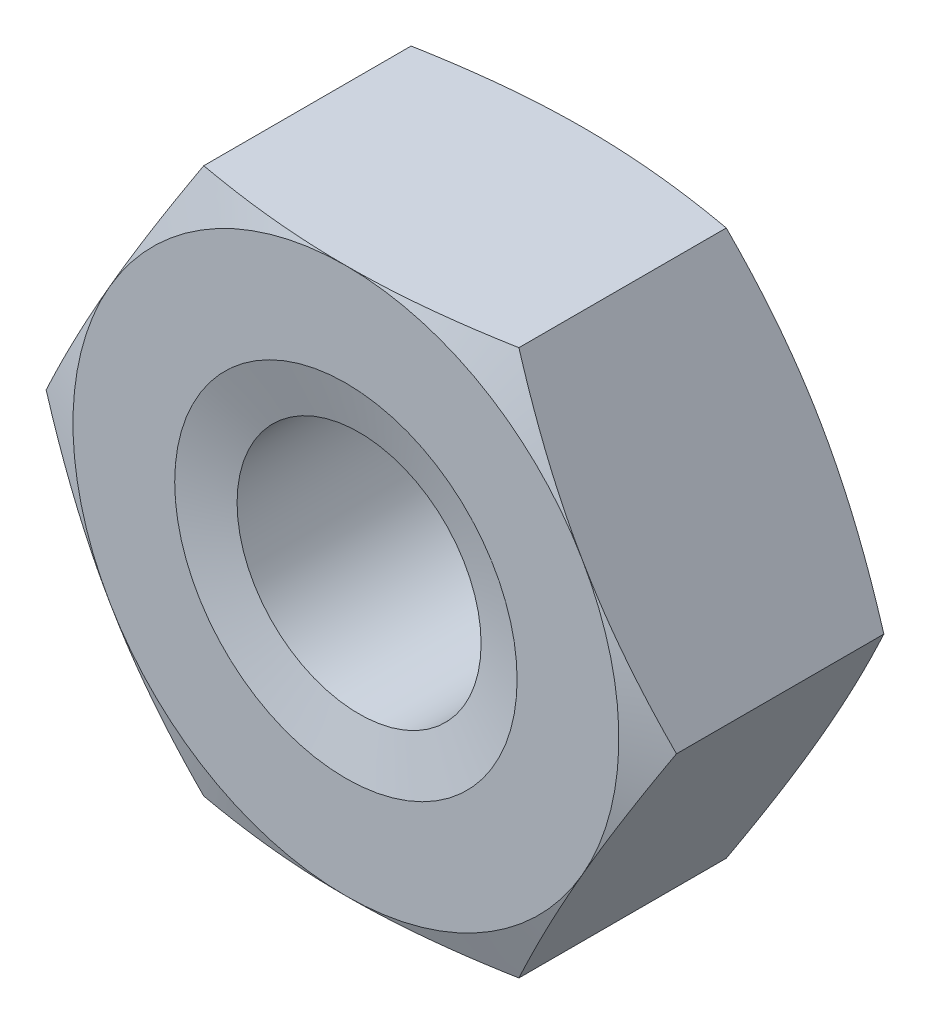
ISO-10303-21;
HEADER;
FILE_DESCRIPTION(('STEP AP214'),'2;1');
FILE_NAME('part.step','',(''),(''),'','','');
FILE_SCHEMA(('AUTOMOTIVE_DESIGN { 1 0 10303 214 1 1 1 1 }'));
ENDSEC;
DATA;
#1=APPLICATION_CONTEXT('core data for automotive mechanical design processes');
#2=APPLICATION_PROTOCOL_DEFINITION('international standard','automotive_design',2000,#1);
#3=PRODUCT_CONTEXT('',#1,'mechanical');
#4=PRODUCT('Part','Part','',(#3));
#5=PRODUCT_RELATED_PRODUCT_CATEGORY('part','',(#4));
#6=PRODUCT_DEFINITION_FORMATION('','',#4);
#7=PRODUCT_DEFINITION_CONTEXT('part definition',#1,'design');
#8=PRODUCT_DEFINITION('design','',#6,#7);
#9=PRODUCT_DEFINITION_SHAPE('','',#8);
#10=(LENGTH_UNIT() NAMED_UNIT(*) SI_UNIT(.MILLI.,.METRE.));
#11=(NAMED_UNIT(*) PLANE_ANGLE_UNIT() SI_UNIT($,.RADIAN.));
#12=(NAMED_UNIT(*) SI_UNIT($,.STERADIAN.) SOLID_ANGLE_UNIT());
#13=UNCERTAINTY_MEASURE_WITH_UNIT(LENGTH_MEASURE(1.E-05),#10,'distance_accuracy_value','');
#14=(GEOMETRIC_REPRESENTATION_CONTEXT(3) GLOBAL_UNCERTAINTY_ASSIGNED_CONTEXT((#13)) GLOBAL_UNIT_ASSIGNED_CONTEXT((#10,
#11,#12)) REPRESENTATION_CONTEXT('',''));
#15=CARTESIAN_POINT('',(0.,0.,0.));
#16=DIRECTION('',(0.,0.,1.));
#17=DIRECTION('',(1.,0.,0.));
#18=AXIS2_PLACEMENT_3D('',#15,#16,#17);
#19=CARTESIAN_POINT('',(-3.175426480543,0.,-0.24));
#20=DIRECTION('',(0.866025403784329,0.50000000000019,0.));
#21=DIRECTION('',(-0.50000000000019,0.866025403784329,0.));
#22=AXIS2_PLACEMENT_3D('',#19,#20,#21);
#23=PLANE('',#22);
#24=DIRECTION('',(0.,0.,1.));
#25=VECTOR('',#24,1.);
#26=CARTESIAN_POINT('',(-1.587713240272,-2.75,-0.24));
#27=LINE('',#26,#25);
#28=CARTESIAN_POINT('',(-1.58771324027277,-2.74999999999756,0.155291427089969));
#29=VERTEX_POINT('',#28);
#30=CARTESIAN_POINT('',(-1.58771324026981,-2.74999999999714,2.24470857290511));
#31=VERTEX_POINT('',#30);
#32=EDGE_CURVE('E179',#29,#31,#27,.T.);
#33=ORIENTED_EDGE('',*,*,#32,.T.);
#34=CARTESIAN_POINT('',(-2.3815698604069,-1.37499999999994,2.39999999998386));
#35=CARTESIAN_POINT('',(-2.34824320211493,-1.43272346540809,2.40000440913265));
#36=CARTESIAN_POINT('',(-2.31491830065855,-1.49044388788773,2.39911501488682));
#37=CARTESIAN_POINT('',(-2.24829372770065,-1.60584103328334,2.39558635688911));
#38=CARTESIAN_POINT('',(-2.21499405471668,-1.66351775876697,2.39294720548465));
#39=CARTESIAN_POINT('',(-2.11530147594445,-1.83619037033794,2.38247650050293));
#40=CARTESIAN_POINT('',(-2.04897219830061,-1.95107604924637,2.37209137681741));
#41=CARTESIAN_POINT('',(-1.91666658677657,-2.18023609053235,2.34519123201661));
#42=CARTESIAN_POINT('',(-1.85069011061307,-2.29451069935184,2.32867890651217));
#43=CARTESIAN_POINT('',(-1.71897479637298,-2.52264831575045,2.29040515233641));
#44=CARTESIAN_POINT('',(-1.6532367451182,-2.63650996051424,2.26863280533776));
#45=CARTESIAN_POINT('',(-1.58771324027403,-2.74999999999427,2.24470857290525));
#46=B_SPLINE_CURVE_WITH_KNOTS('',3,(#34,#35,#36,#37,#38,#39,#40,#41,#42,#43,#44,#45),
.UNSPECIFIED.,.F.,.F.,(4,2,2,2,2,4),(0.,0.199947384513835,0.399881932162586,0.798895212099746,
1.19773315722728,1.5974062004191),.UNSPECIFIED.);
#47=CARTESIAN_POINT('',(-2.38156986042809,-1.37500000001218,2.39999999997492));
#48=VERTEX_POINT('',#47);
#49=EDGE_CURVE('E142',#48,#31,#46,.T.);
#50=ORIENTED_EDGE('',*,*,#49,.F.);
#51=CARTESIAN_POINT('',(-3.17542648054005,-5.10834675836833E-12,2.24470857290496));
#52=CARTESIAN_POINT('',(-3.10990297569586,-0.113490039485175,2.2686328053375));
#53=CARTESIAN_POINT('',(-3.04416492444105,-0.227351684249007,2.29040515233618));
#54=CARTESIAN_POINT('',(-2.91244961020092,-0.455489300647699,2.32867890651199));
#55=CARTESIAN_POINT('',(-2.84647313403739,-0.569763909467235,2.34519123201645));
#56=CARTESIAN_POINT('',(-2.71416752251331,-0.798923950753296,2.37209137681731));
#57=CARTESIAN_POINT('',(-2.64783824486944,-0.913809629661767,2.38247650050284));
#58=CARTESIAN_POINT('',(-2.54814566609717,-1.0864822412328,2.3929472054846));
#59=CARTESIAN_POINT('',(-2.5148459931132,-1.14415896671646,2.39558635688907));
#60=CARTESIAN_POINT('',(-2.44822142015527,-1.25955611211211,2.3991150148868));
#61=CARTESIAN_POINT('',(-2.41489651869888,-1.31727653459177,2.40000440913264));
#62=CARTESIAN_POINT('',(-2.3815698604069,-1.37499999999994,2.39999999998386));
#63=B_SPLINE_CURVE_WITH_KNOTS('',3,(#51,#52,#53,#54,#55,#56,#57,#58,#59,#60,#61,#62),
.UNSPECIFIED.,.F.,.F.,(4,2,2,2,2,4),(0.,0.399673043191968,0.798510988319655,1.19752426825697,
1.39745881590579,1.5974062004197),.UNSPECIFIED.);
#64=CARTESIAN_POINT('',(-3.17542648054161,-2.46421124305427E-12,2.24470857290439));
#65=VERTEX_POINT('',#64);
#66=EDGE_CURVE('E118',#65,#48,#63,.T.);
#67=ORIENTED_EDGE('',*,*,#66,.F.);
#68=DIRECTION('',(0.,0.,1.));
#69=VECTOR('',#68,1.);
#70=CARTESIAN_POINT('',(-3.17542648054317,1.79977560632594E-13,-0.24));
#71=LINE('',#70,#69);
#72=CARTESIAN_POINT('',(-3.17542648054061,1.61831822866144E-13,0.155291427089651));
#73=VERTEX_POINT('',#72);
#74=EDGE_CURVE('E114',#65,#73,#71,.F.);
#75=ORIENTED_EDGE('',*,*,#74,.T.);
#76=CARTESIAN_POINT('',(-2.3815698604069,-1.37499999999994,1.0551267874012E-11));
#77=CARTESIAN_POINT('',(-2.4148965186989,-1.31727653459173,-4.40913823378671E-06));
#78=CARTESIAN_POINT('',(-2.44822142015531,-1.25955611211203,0.000884985107605757));
#79=CARTESIAN_POINT('',(-2.51484599311328,-1.1441589667163,0.0044136431053384));
#80=CARTESIAN_POINT('',(-2.54814566609728,-1.08648224123261,0.0070527945098167));
#81=CARTESIAN_POINT('',(-2.64783824486961,-0.913809629661465,0.0175234994915843));
#82=CARTESIAN_POINT('',(-2.71416752251353,-0.798923950752919,0.0279086231771364));
#83=CARTESIAN_POINT('',(-2.84647313403769,-0.569763909466709,0.0548087679780271));
#84=CARTESIAN_POINT('',(-2.91244961020127,-0.4554893006471,0.0713210934825101));
#85=CARTESIAN_POINT('',(-3.04416492444148,-0.227351684248261,0.109594847658363));
#86=CARTESIAN_POINT('',(-3.10990297569633,-0.113490039484356,0.131367194657068));
#87=CARTESIAN_POINT('',(-3.17542648054056,-4.21761128407999E-12,0.155291427089634));
#88=B_SPLINE_CURVE_WITH_KNOTS('',3,(#76,#77,#78,#79,#80,#81,#82,#83,#84,#85,#86,#87),
.UNSPECIFIED.,.F.,.F.,(4,2,2,2,2,4),(0.,0.199947384514041,0.399881932163,0.798895212100572,
1.19773315722852,1.59740620042075),.UNSPECIFIED.);
#89=CARTESIAN_POINT('',(-2.3815698604281,-1.37500000001218,1.94866754439335E-11));
#90=VERTEX_POINT('',#89);
#91=EDGE_CURVE('E21',#90,#73,#88,.T.);
#92=ORIENTED_EDGE('',*,*,#91,.F.);
#93=CARTESIAN_POINT('',(-1.58771324027354,-2.74999999999513,0.155291427089339));
#94=CARTESIAN_POINT('',(-1.65323674511775,-2.63650996051503,0.1313671946568));
#95=CARTESIAN_POINT('',(-1.71897479637257,-2.52264831575117,0.109594847658122));
#96=CARTESIAN_POINT('',(-1.85069011061273,-2.29451069935242,0.0713210934823235));
#97=CARTESIAN_POINT('',(-1.91666658677628,-2.18023609053285,0.0548087679778674));
#98=CARTESIAN_POINT('',(-2.0489721983004,-1.95107604924673,0.0279086231770283));
#99=CARTESIAN_POINT('',(-2.11530147594429,-1.83619037033823,0.0175234994915011));
#100=CARTESIAN_POINT('',(-2.21499405471658,-1.66351775876715,0.00705279450976718));
#101=CARTESIAN_POINT('',(-2.24829372770056,-1.60584103328348,0.0044136431052995));
#102=CARTESIAN_POINT('',(-2.31491830065851,-1.4904438878878,0.000884985107587105));
#103=CARTESIAN_POINT('',(-2.3482432021149,-1.43272346540813,-4.40913824281038E-06));
#104=CARTESIAN_POINT('',(-2.3815698604069,-1.37499999999994,1.05514979118494E-11));
#105=B_SPLINE_CURVE_WITH_KNOTS('',3,(#93,#94,#95,#96,#97,#98,#99,#100,#101,#102,#103,#104),
.UNSPECIFIED.,.F.,.F.,(4,2,2,2,2,4),(0.,0.399673043192068,0.798510988319854,1.19752426825726,
1.39745881590614,1.5974062004201),.UNSPECIFIED.);
#106=EDGE_CURVE('E111',#29,#90,#105,.T.);
#107=ORIENTED_EDGE('',*,*,#106,.F.);
#108=EDGE_LOOP('',(#33,#50,#67,#75,#92,#107));
#109=FACE_BOUND('',#108,.T.);
#110=ADVANCED_FACE('F17',(#109),#23,.F.);
#111=CARTESIAN_POINT('',(-1.587713240271,2.75,-0.24));
#112=DIRECTION('',(0.866025403784329,-0.50000000000019,0.));
#113=DIRECTION('',(0.50000000000019,0.866025403784329,0.));
#114=AXIS2_PLACEMENT_3D('',#111,#112,#113);
#115=PLANE('',#114);
#116=ORIENTED_EDGE('',*,*,#74,.F.);
#117=CARTESIAN_POINT('',(-2.3815698604071,1.37500000000006,2.39999999998377));
#118=CARTESIAN_POINT('',(-2.41489651869908,1.31727653459189,2.40000440913255));
#119=CARTESIAN_POINT('',(-2.44822142015547,1.25955611211224,2.39911501488672));
#120=CARTESIAN_POINT('',(-2.51484599311339,1.1441589667166,2.39558635688899));
#121=CARTESIAN_POINT('',(-2.54814566609736,1.08648224123295,2.39294720548451));
#122=CARTESIAN_POINT('',(-2.64783824486962,0.913809629661932,2.38247650050276));
#123=CARTESIAN_POINT('',(-2.71416752251348,0.798923950753472,2.37209137681723));
#124=CARTESIAN_POINT('',(-2.84647313403755,0.569763909467433,2.34519123201638));
#125=CARTESIAN_POINT('',(-2.91244961020108,0.455489300647908,2.32867890651192));
#126=CARTESIAN_POINT('',(-3.0441649244412,0.227351684249238,2.29040515233612));
#127=CARTESIAN_POINT('',(-3.109902975696,0.113490039485417,2.26863280533745));
#128=CARTESIAN_POINT('',(-3.17542648054018,5.36142603120942E-12,2.24470857290491));
#129=B_SPLINE_CURVE_WITH_KNOTS('',3,(#117,#118,#119,#120,#121,#122,#123,#124,#125,#126,#127,
#128),.UNSPECIFIED.,.F.,.F.,(4,2,2,2,2,4),(0.,0.19994738451389,0.399881932162698,
0.798895212099969,1.19773315722762,1.59740620041955),.UNSPECIFIED.);
#130=CARTESIAN_POINT('',(-2.3815698604282,1.37500000001224,2.39999999997488));
#131=VERTEX_POINT('',#130);
#132=EDGE_CURVE('E368',#131,#65,#129,.T.);
#133=ORIENTED_EDGE('',*,*,#132,.F.);
#134=CARTESIAN_POINT('',(-1.58771324027425,2.74999999999438,2.24470857290518));
#135=CARTESIAN_POINT('',(-1.65323674511841,2.63650996051435,2.26863280533769));
#136=CARTESIAN_POINT('',(-1.71897479637319,2.52264831575056,2.29040515233634));
#137=CARTESIAN_POINT('',(-1.85069011061328,2.29451069935195,2.32867890651209));
#138=CARTESIAN_POINT('',(-1.91666658677678,2.18023609053246,2.34519123201652));
#139=CARTESIAN_POINT('',(-2.04897219830082,1.95107604924648,2.37209137681733));
#140=CARTESIAN_POINT('',(-2.11530147594466,1.83619037033806,2.38247650050284));
#141=CARTESIAN_POINT('',(-2.21499405471689,1.66351775876708,2.39294720548456));
#142=CARTESIAN_POINT('',(-2.24829372770086,1.60584103328345,2.39558635688903));
#143=CARTESIAN_POINT('',(-2.31491830065876,1.49044388788784,2.39911501488673));
#144=CARTESIAN_POINT('',(-2.34824320211513,1.43272346540821,2.40000440913256));
#145=CARTESIAN_POINT('',(-2.3815698604071,1.37500000000006,2.39999999998377));
#146=B_SPLINE_CURVE_WITH_KNOTS('',3,(#134,#135,#136,#137,#138,#139,#140,#141,#142,#143,#144,
#145),.UNSPECIFIED.,.F.,.F.,(4,2,2,2,2,4),(0.,0.399673043191813,0.798510988319346,
1.1975242682565,1.39745881590525,1.59740620041908),.UNSPECIFIED.);
#147=CARTESIAN_POINT('',(-1.58771324027312,2.74999999999719,2.24470857290449));
#148=VERTEX_POINT('',#147);
#149=EDGE_CURVE('E144',#148,#131,#146,.T.);
#150=ORIENTED_EDGE('',*,*,#149,.F.);
#151=DIRECTION('',(0.,0.,1.));
#152=VECTOR('',#151,1.);
#153=CARTESIAN_POINT('',(-1.587713240272,2.75,-0.24));
#154=LINE('',#153,#152);
#155=CARTESIAN_POINT('',(-1.5877132402702,2.74999999999762,0.155291427089518));
#156=VERTEX_POINT('',#155);
#157=EDGE_CURVE('E370',#148,#156,#154,.F.);
#158=ORIENTED_EDGE('',*,*,#157,.T.);
#159=CARTESIAN_POINT('',(-2.3815698604071,1.37500000000006,1.0638541204561E-11));
#160=CARTESIAN_POINT('',(-2.34824320211511,1.43272346540825,-4.40913815561161E-06));
#161=CARTESIAN_POINT('',(-2.31491830065872,1.49044388788792,0.000884985107674242));
#162=CARTESIAN_POINT('',(-2.24829372770077,1.6058410332836,0.00441364310538625));
#163=CARTESIAN_POINT('',(-2.21499405471678,1.66351775876727,0.00705279450985359));
#164=CARTESIAN_POINT('',(-2.1153014759445,1.83619037033834,0.0175234994915864));
#165=CARTESIAN_POINT('',(-2.04897219830061,1.95107604924684,0.0279086231771127));
#166=CARTESIAN_POINT('',(-1.91666658677649,2.18023609053296,0.0548087679779492));
#167=CARTESIAN_POINT('',(-1.85069011061295,2.29451069935253,0.0713210934824036));
#168=CARTESIAN_POINT('',(-1.71897479637278,2.52264831575128,0.109594847658199));
#169=CARTESIAN_POINT('',(-1.65323674511796,2.63650996051514,0.131367194656875));
#170=CARTESIAN_POINT('',(-1.58771324027375,2.74999999999523,0.155291427089412));
#171=B_SPLINE_CURVE_WITH_KNOTS('',3,(#159,#160,#161,#162,#163,#164,#165,#166,#167,#168,#169,
#170),.UNSPECIFIED.,.F.,.F.,(4,2,2,2,2,4),(0.,0.199947384513959,0.399881932162834,
0.798895212100241,1.19773315722802,1.59740620042009),.UNSPECIFIED.);
#172=CARTESIAN_POINT('',(-2.3815698604282,1.37500000001224,1.95301289290131E-11));
#173=VERTEX_POINT('',#172);
#174=EDGE_CURVE('E141',#173,#156,#171,.T.);
#175=ORIENTED_EDGE('',*,*,#174,.F.);
#176=CARTESIAN_POINT('',(-3.17542648054065,4.54112647686149E-12,0.155291427089667));
#177=CARTESIAN_POINT('',(-3.10990297569643,0.113490039484663,0.131367194657108));
#178=CARTESIAN_POINT('',(-3.04416492444159,0.227351684248552,0.10959484765841));
#179=CARTESIAN_POINT('',(-2.9124496102014,0.455489300647357,0.0713210934825706));
#180=CARTESIAN_POINT('',(-2.84647313403783,0.56976390946695,0.0548087679780937));
#181=CARTESIAN_POINT('',(-2.71416752251368,0.798923950753125,0.027908623177213));
#182=CARTESIAN_POINT('',(-2.64783824486978,0.913809629661654,0.0175234994916649));
#183=CARTESIAN_POINT('',(-2.54814566609747,1.08648224123278,0.00705279450990112));
#184=CARTESIAN_POINT('',(-2.51484599311347,1.14415896671646,0.00441364310542375));
#185=CARTESIAN_POINT('',(-2.44822142015551,1.25955611211217,0.000884985107692412));
#186=CARTESIAN_POINT('',(-2.4148965186991,1.31727653459186,-4.40913814673691E-06));
#187=CARTESIAN_POINT('',(-2.3815698604071,1.37500000000006,1.06385475230101E-11));
#188=B_SPLINE_CURVE_WITH_KNOTS('',3,(#176,#177,#178,#179,#180,#181,#182,#183,#184,#185,#186,
#187),.UNSPECIFIED.,.F.,.F.,(4,2,2,2,2,4),(0.,0.399673043192169,0.798510988320057,
1.19752426825757,1.3974588159065,1.59740620042051),.UNSPECIFIED.);
#189=EDGE_CURVE('E123',#73,#173,#188,.T.);
#190=ORIENTED_EDGE('',*,*,#189,.F.);
#191=EDGE_LOOP('',(#116,#133,#150,#158,#175,#190));
#192=FACE_BOUND('',#191,.T.);
#193=ADVANCED_FACE('F196',(#192),#115,.F.);
#194=CARTESIAN_POINT('',(-1.587713240271,-2.75,-0.24));
#195=DIRECTION('',(0.,1.,0.));
#196=DIRECTION('',(-1.,0.,0.));
#197=AXIS2_PLACEMENT_3D('',#194,#195,#196);
#198=PLANE('',#197);
#199=DIRECTION('',(0.,0.,1.));
#200=VECTOR('',#199,1.);
#201=CARTESIAN_POINT('',(1.587713240271,-2.75,-0.24));
#202=LINE('',#201,#200);
#203=CARTESIAN_POINT('',(1.58771326148801,-2.75,0.155291430962789));
#204=VERTEX_POINT('',#203);
#205=CARTESIAN_POINT('',(1.5877132402695,-2.7499999999974,2.24470857290509));
#206=VERTEX_POINT('',#205);
#207=EDGE_CURVE('E239',#204,#206,#202,.T.);
#208=ORIENTED_EDGE('',*,*,#207,.T.);
#209=CARTESIAN_POINT('',(0.,-2.75,2.39999999998375));
#210=CARTESIAN_POINT('',(0.0666533165839106,-2.75,2.40000440913254));
#211=CARTESIAN_POINT('',(0.133303119496627,-2.75,2.3991150148867));
#212=CARTESIAN_POINT('',(0.266552265412374,-2.75,2.39558635688899));
#213=CARTESIAN_POINT('',(0.333151611380276,-2.75,2.39294720548452));
#214=CARTESIAN_POINT('',(0.532536768924639,-2.75,2.38247650050279));
#215=CARTESIAN_POINT('',(0.665195324212273,-2.75,2.37209137681727));
#216=CARTESIAN_POINT('',(0.929806547260215,-2.75,2.34519123201645));
#217=CARTESIAN_POINT('',(1.06175949958717,-2.75,2.32867890651201));
#218=CARTESIAN_POINT('',(1.32519012806722,-2.75,2.29040515233625));
#219=CARTESIAN_POINT('',(1.45666623057672,-2.75,2.2686328053376));
#220=CARTESIAN_POINT('',(1.58771324026499,-2.75,2.24470857290509));
#221=B_SPLINE_CURVE_WITH_KNOTS('',3,(#209,#210,#211,#212,#213,#214,#215,#216,#217,#218,#219,
#220),.UNSPECIFIED.,.F.,.F.,(4,2,2,2,2,4),(0.,0.199947384513818,0.399881932162554,
0.798895212099682,1.19773315722719,1.59740620041897),.UNSPECIFIED.);
#222=CARTESIAN_POINT('',(0.,-2.75000000002433,2.39999999997487));
#223=VERTEX_POINT('',#222);
#224=EDGE_CURVE('E211',#223,#206,#221,.T.);
#225=ORIENTED_EDGE('',*,*,#224,.F.);
#226=CARTESIAN_POINT('',(-1.58771324026559,-2.75,2.24470857290498));
#227=CARTESIAN_POINT('',(-1.45666623057727,-2.75,2.26863280533751));
#228=CARTESIAN_POINT('',(-1.32519012806772,-2.75,2.29040515233618));
#229=CARTESIAN_POINT('',(-1.06175949958757,-2.75,2.32867890651196));
#230=CARTESIAN_POINT('',(-0.929806547260567,-2.75,2.34519123201641));
#231=CARTESIAN_POINT('',(-0.665195324212526,-2.75,2.37209137681725));
#232=CARTESIAN_POINT('',(-0.532536768924842,-2.75,2.38247650050278));
#233=CARTESIAN_POINT('',(-0.333151611380404,-2.75,2.39294720548451));
#234=CARTESIAN_POINT('',(-0.266552265412476,-2.75,2.39558635688898));
#235=CARTESIAN_POINT('',(-0.133303119496678,-2.75,2.3991150148867));
#236=CARTESIAN_POINT('',(-0.0666533165839364,-2.75,2.40000440913254));
#237=CARTESIAN_POINT('',(0.,-2.75,2.39999999998375));
#238=B_SPLINE_CURVE_WITH_KNOTS('',3,(#226,#227,#228,#229,#230,#231,#232,#233,#234,#235,#236,
#237),.UNSPECIFIED.,.F.,.F.,(4,2,2,2,2,4),(0.,0.399673043191936,0.798510988319592,
1.19752426825687,1.39745881590568,1.59740620041958),.UNSPECIFIED.);
#239=EDGE_CURVE('E180',#31,#223,#238,.T.);
#240=ORIENTED_EDGE('',*,*,#239,.F.);
#241=ORIENTED_EDGE('',*,*,#32,.F.);
#242=CARTESIAN_POINT('',(0.,-2.75,1.06606569170843E-11));
#243=CARTESIAN_POINT('',(-0.0666533165839792,-2.75,-4.40913812902332E-06));
#244=CARTESIAN_POINT('',(-0.133303119496763,-2.75,0.000884985107705789));
#245=CARTESIAN_POINT('',(-0.266552265412645,-2.75,0.00441364310542863));
#246=CARTESIAN_POINT('',(-0.333151611380614,-2.75,0.00705279450990184));
#247=CARTESIAN_POINT('',(-0.532536768925177,-2.75,0.0175234994916535));
#248=CARTESIAN_POINT('',(-0.665195324212944,-2.75,0.027908623177194));
#249=CARTESIAN_POINT('',(-0.92980654726115,-2.75,0.0548087679780612));
#250=CARTESIAN_POINT('',(-1.06175949958824,-2.75,0.0713210934825321));
#251=CARTESIAN_POINT('',(-1.32519012806854,-2.75,0.109594847658361));
#252=CARTESIAN_POINT('',(-1.45666623057818,-2.75,0.131367194657055));
#253=CARTESIAN_POINT('',(-1.58771324026658,-2.75,0.155291427089609));
#254=B_SPLINE_CURVE_WITH_KNOTS('',3,(#242,#243,#244,#245,#246,#247,#248,#249,#250,#251,#252,
#253),.UNSPECIFIED.,.F.,.F.,(4,2,2,2,2,4),(0.,0.19994738451402,0.399881932162958,
0.798895212100489,1.19773315722839,1.59740620042058),.UNSPECIFIED.);
#255=CARTESIAN_POINT('',(0.,-2.75000000002433,1.95411853954599E-11));
#256=VERTEX_POINT('',#255);
#257=EDGE_CURVE('E140',#256,#29,#254,.T.);
#258=ORIENTED_EDGE('',*,*,#257,.F.);
#259=CARTESIAN_POINT('',(1.58771327732686,-2.7499999593157,0.155291464302442));
#260=CARTESIAN_POINT('',(1.45666626710131,-2.74999998542488,0.131367211759161));
#261=CARTESIAN_POINT('',(1.32519016218621,-2.74999999610333,0.109594855932478));
#262=CARTESIAN_POINT('',(1.06175952743068,-2.75000000388853,0.0713210942186422));
#263=CARTESIAN_POINT('',(0.929806571238466,-2.75000000102358,0.0548087699752594));
#264=CARTESIAN_POINT('',(0.665195341168241,-2.74999999897597,0.0279086253418865));
#265=CARTESIAN_POINT('',(0.532536782725308,-2.74999999979493,0.0175235005470441));
#266=CARTESIAN_POINT('',(0.333151620218137,-2.75000000010276,0.0070527948081339));
#267=CARTESIAN_POINT('',(0.266552272507049,-2.75000000005138,0.0044136433027394));
#268=CARTESIAN_POINT('',(0.133303123058262,-2.74999999994862,0.000884985192435597));
#269=CARTESIAN_POINT('',(0.0666533183556617,-2.74999999989723,-4.4090639250771E-06));
#270=CARTESIAN_POINT('',(0.,-2.75,1.0660608246799E-11));
#271=B_SPLINE_CURVE_WITH_KNOTS('',3,(#259,#260,#261,#262,#263,#264,#265,#266,#267,#268,#269,
#270),.UNSPECIFIED.,.F.,.F.,(4,2,2,2,2,4),(0.,0.399673054603368,0.798511010517441,
1.19752430029263,1.39745885316324,1.59740624302815),.UNSPECIFIED.);
#272=EDGE_CURVE('E205',#204,#256,#271,.T.);
#273=ORIENTED_EDGE('',*,*,#272,.F.);
#274=EDGE_LOOP('',(#208,#225,#240,#241,#258,#273));
#275=FACE_BOUND('',#274,.T.);
#276=ADVANCED_FACE('F191',(#275),#198,.F.);
#277=CARTESIAN_POINT('',(1.587713240271,2.75,-0.24));
#278=DIRECTION('',(0.,-1.,0.));
#279=DIRECTION('',(1.,0.,0.));
#280=AXIS2_PLACEMENT_3D('',#277,#278,#279);
#281=PLANE('',#280);
#282=ORIENTED_EDGE('',*,*,#157,.F.);
#283=CARTESIAN_POINT('',(0.,2.75,2.39999999998375));
#284=CARTESIAN_POINT('',(-0.0666533165839398,2.75,2.40000440913254));
#285=CARTESIAN_POINT('',(-0.133303119496685,2.75,2.3991150148867));
#286=CARTESIAN_POINT('',(-0.26655226541249,2.75,2.39558635688898));
#287=CARTESIAN_POINT('',(-0.333151611380421,2.75,2.39294720548451));
#288=CARTESIAN_POINT('',(-0.532536768924869,2.75,2.38247650050277));
#289=CARTESIAN_POINT('',(-0.66519532421256,2.75,2.37209137681724));
#290=CARTESIAN_POINT('',(-0.929806547260614,2.75,2.34519123201641));
#291=CARTESIAN_POINT('',(-1.06175949958762,2.75,2.32867890651195));
#292=CARTESIAN_POINT('',(-1.32519012806778,2.75,2.29040515233617));
#293=CARTESIAN_POINT('',(-1.45666623057734,2.75,2.26863280533749));
#294=CARTESIAN_POINT('',(-1.58771324026567,2.75,2.24470857290496));
#295=B_SPLINE_CURVE_WITH_KNOTS('',3,(#283,#284,#285,#286,#287,#288,#289,#290,#291,#292,#293,
#294),.UNSPECIFIED.,.F.,.F.,(4,2,2,2,2,4),(0.,0.199947384513905,0.399881932162726,
0.798895212100026,1.1977331572277,1.59740620041966),.UNSPECIFIED.);
#296=CARTESIAN_POINT('',(0.,2.75000000002433,2.39999999997487));
#297=VERTEX_POINT('',#296);
#298=EDGE_CURVE('E308',#297,#148,#295,.T.);
#299=ORIENTED_EDGE('',*,*,#298,.F.);
#300=CARTESIAN_POINT('',(1.58771322109896,2.75,2.24470857640313));
#301=CARTESIAN_POINT('',(1.45666621297134,2.75,2.26863280833502));
#302=CARTESIAN_POINT('',(1.3251901120329,2.75,2.29040515486162));
#303=CARTESIAN_POINT('',(1.0617594867078,2.75,2.32867890818845));
#304=CARTESIAN_POINT('',(0.929806535964648,2.75,2.34519123331562));
#305=CARTESIAN_POINT('',(0.665195316108504,2.75,2.3720913774904));
#306=CARTESIAN_POINT('',(0.532536762428881,2.75,2.38247650092732));
#307=CARTESIAN_POINT('',(0.333151607309985,2.75,2.3929472056564));
#308=CARTESIAN_POINT('',(0.266552262154953,2.75,2.39558635699669));
#309=CARTESIAN_POINT('',(0.133303117866881,2.75,2.39911501490835));
#310=CARTESIAN_POINT('',(0.0666533157689713,2.75,2.40000440913232));
#311=CARTESIAN_POINT('',(0.,2.75,2.39999999998375));
#312=B_SPLINE_CURVE_WITH_KNOTS('',3,(#300,#301,#302,#303,#304,#305,#306,#307,#308,#309,#310,
#311),.UNSPECIFIED.,.F.,.F.,(4,2,2,2,2,4),(0.,0.399673038314091,0.798510978589106,
1.19752425366471,1.39745879886987,1.59740618093933),.UNSPECIFIED.);
#313=CARTESIAN_POINT('',(1.58771323068488,2.74999999999994,2.2447085746536));
#314=VERTEX_POINT('',#313);
#315=EDGE_CURVE('E301',#314,#297,#312,.T.);
#316=ORIENTED_EDGE('',*,*,#315,.F.);
#317=DIRECTION('',(0.,0.,1.));
#318=VECTOR('',#317,1.);
#319=CARTESIAN_POINT('',(1.58771324027079,2.74999999999988,-0.24));
#320=LINE('',#319,#318);
#321=CARTESIAN_POINT('',(1.58771323068479,2.74999999999994,0.155291425340793));
#322=VERTEX_POINT('',#321);
#323=EDGE_CURVE('E378',#314,#322,#320,.F.);
#324=ORIENTED_EDGE('',*,*,#323,.T.);
#325=CARTESIAN_POINT('',(0.,2.75,1.06604009112723E-11));
#326=CARTESIAN_POINT('',(0.066653315768965,2.75,-4.40913791652754E-06));
#327=CARTESIAN_POINT('',(0.133303117866867,2.75,0.000884985086052405));
#328=CARTESIAN_POINT('',(0.266552262154924,2.75,0.00441364299771679));
#329=CARTESIAN_POINT('',(0.333151607309949,2.75,0.00705279433800563));
#330=CARTESIAN_POINT('',(0.532536762428823,2.75,0.0175234990670851));
#331=CARTESIAN_POINT('',(0.665195316108431,2.75,0.0279086225039978));
#332=CARTESIAN_POINT('',(0.929806535964546,2.75,0.0548087666787729));
#333=CARTESIAN_POINT('',(1.06175948670768,2.75,0.0713210918059425));
#334=CARTESIAN_POINT('',(1.32519011203275,2.75,0.109594845132766));
#335=CARTESIAN_POINT('',(1.45666621297118,2.75,0.131367191659364));
#336=CARTESIAN_POINT('',(1.58771322109878,2.75,0.155291423591244));
#337=B_SPLINE_CURVE_WITH_KNOTS('',3,(#325,#326,#327,#328,#329,#330,#331,#332,#333,#334,#335,
#336),.UNSPECIFIED.,.F.,.F.,(4,2,2,2,2,4),(0.,0.199947382069439,0.399881927274579,
0.798895202350136,1.19773314262511,1.59740618093915),.UNSPECIFIED.);
#338=CARTESIAN_POINT('',(0.,2.75000000002433,1.9541086974118E-11));
#339=VERTEX_POINT('',#338);
#340=EDGE_CURVE('E295',#339,#322,#337,.T.);
#341=ORIENTED_EDGE('',*,*,#340,.F.);
#342=CARTESIAN_POINT('',(-1.58771324026666,2.75,0.155291427089624));
#343=CARTESIAN_POINT('',(-1.45666623057825,2.75,0.131367194657067));
#344=CARTESIAN_POINT('',(-1.32519012806861,2.75,0.109594847658372));
#345=CARTESIAN_POINT('',(-1.06175949958829,2.75,0.0713210934825389));
#346=CARTESIAN_POINT('',(-0.929806547261196,2.75,0.0548087679780664));
#347=CARTESIAN_POINT('',(-0.665195324212977,2.75,0.0279086231771966));
#348=CARTESIAN_POINT('',(-0.532536768925203,2.75,0.017523499491655));
#349=CARTESIAN_POINT('',(-0.333151611380629,2.75,0.00705279450990227));
#350=CARTESIAN_POINT('',(-0.266552265412657,2.75,0.00441364310542878));
#351=CARTESIAN_POINT('',(-0.133303119496768,2.75,0.000884985107705576));
#352=CARTESIAN_POINT('',(-0.0666533165839806,2.75,-4.40913812932041E-06));
#353=CARTESIAN_POINT('',(0.,2.75,1.06603972504092E-11));
#354=B_SPLINE_CURVE_WITH_KNOTS('',3,(#342,#343,#344,#345,#346,#347,#348,#349,#350,#351,#352,
#353),.UNSPECIFIED.,.F.,.F.,(4,2,2,2,2,4),(0.,0.399673043192208,0.798510988320135,
1.19752426825769,1.39745881590663,1.59740620042066),.UNSPECIFIED.);
#355=EDGE_CURVE('E245',#156,#339,#354,.T.);
#356=ORIENTED_EDGE('',*,*,#355,.F.);
#357=EDGE_LOOP('',(#282,#299,#316,#324,#341,#356));
#358=FACE_BOUND('',#357,.T.);
#359=ADVANCED_FACE('F195',(#358),#281,.F.);
#360=CARTESIAN_POINT('',(1.587713240271,-2.75,-0.24));
#361=DIRECTION('',(-0.866025403784329,0.50000000000019,0.));
#362=DIRECTION('',(-0.50000000000019,-0.866025403784329,0.));
#363=AXIS2_PLACEMENT_3D('',#360,#361,#362);
#364=PLANE('',#363);
#365=DIRECTION('',(0.,0.,1.));
#366=VECTOR('',#365,1.);
#367=CARTESIAN_POINT('',(3.175426480543,0.,-0.24));
#368=LINE('',#367,#366);
#369=CARTESIAN_POINT('',(3.17542648051348,0.,0.155291427060356));
#370=VERTEX_POINT('',#369);
#371=CARTESIAN_POINT('',(3.17542648051348,0.,2.24470857292264));
#372=VERTEX_POINT('',#371);
#373=EDGE_CURVE('E375',#370,#372,#368,.T.);
#374=ORIENTED_EDGE('',*,*,#373,.T.);
#375=CARTESIAN_POINT('',(2.3815698604071,-1.37500000000006,2.39999999998377));
#376=CARTESIAN_POINT('',(2.41489651869886,-1.31727653459228,2.40000440913255));
#377=CARTESIAN_POINT('',(2.44822142015502,-1.25955611211301,2.39911501488673));
#378=CARTESIAN_POINT('',(2.5148459931125,-1.14415896671814,2.39558635688905));
#379=CARTESIAN_POINT('',(2.54814566609625,-1.08648224123488,2.39294720548461));
#380=CARTESIAN_POINT('',(2.64783824486784,-0.913809629665005,2.38247650050299));
#381=CARTESIAN_POINT('',(2.71416752251127,-0.798923950757306,2.37209137681759));
#382=CARTESIAN_POINT('',(2.84647313403447,-0.569763909472777,2.34519123201709));
#383=CARTESIAN_POINT('',(2.91244961019756,-0.455489300654002,2.32867890651283));
#384=CARTESIAN_POINT('',(3.04416492443682,-0.227351684256824,2.2904051523375));
#385=CARTESIAN_POINT('',(3.10990297569119,-0.113490039493747,2.26863280533908));
#386=CARTESIAN_POINT('',(3.17542648053494,-1.44296930018781E-11,2.24470857290682));
#387=B_SPLINE_CURVE_WITH_KNOTS('',3,(#375,#376,#377,#378,#379,#380,#381,#382,#383,#384,#385,
#386),.UNSPECIFIED.,.F.,.F.,(4,2,2,2,2,4),(0.,0.199947384512555,0.399881932160027,
0.798895212094643,1.19773315721964,1.5974062004089),.UNSPECIFIED.);
#388=CARTESIAN_POINT('',(2.3815698604282,-1.37500000001224,2.39999999997488));
#389=VERTEX_POINT('',#388);
#390=EDGE_CURVE('E238',#389,#372,#387,.T.);
#391=ORIENTED_EDGE('',*,*,#390,.F.);
#392=CARTESIAN_POINT('',(1.587713240274,-2.7499999999948,2.24470857290509));
#393=CARTESIAN_POINT('',(1.65323674511819,-2.63650996051474,2.26863280533761));
#394=CARTESIAN_POINT('',(1.71897479637299,-2.52264831575091,2.29040515233627));
#395=CARTESIAN_POINT('',(1.85069011061311,-2.29451069935223,2.32867890651205));
#396=CARTESIAN_POINT('',(1.91666658677664,-2.18023609053271,2.34519123201649));
#397=CARTESIAN_POINT('',(2.04897219830071,-1.95107604924666,2.37209137681731));
#398=CARTESIAN_POINT('',(2.11530147594458,-1.8361903703382,2.38247650050283));
#399=CARTESIAN_POINT('',(2.21499405471684,-1.66351775876717,2.39294720548456));
#400=CARTESIAN_POINT('',(2.24829372770081,-1.60584103328353,2.39558635688902));
#401=CARTESIAN_POINT('',(2.31491830065874,-1.49044388788788,2.39911501488673));
#402=CARTESIAN_POINT('',(2.34824320211512,-1.43272346540823,2.40000440913256));
#403=CARTESIAN_POINT('',(2.3815698604071,-1.37500000000006,2.39999999998377));
#404=B_SPLINE_CURVE_WITH_KNOTS('',3,(#392,#393,#394,#395,#396,#397,#398,#399,#400,#401,#402,
#403),.UNSPECIFIED.,.F.,.F.,(4,2,2,2,2,4),(0.,0.399673043191937,0.798510988319592,
1.19752426825687,1.39745881590568,1.59740620041958),.UNSPECIFIED.);
#405=EDGE_CURVE('E230',#206,#389,#404,.T.);
#406=ORIENTED_EDGE('',*,*,#405,.F.);
#407=ORIENTED_EDGE('',*,*,#207,.F.);
#408=CARTESIAN_POINT('',(2.3815698604071,-1.37500000000006,1.06384823178795E-11));
#409=CARTESIAN_POINT('',(2.3482432041129,-1.43272346194797,-4.4091371121864E-06));
#410=CARTESIAN_POINT('',(2.31491830465398,-1.49044388096793,0.000884985001520814));
#411=CARTESIAN_POINT('',(2.24829373568621,-1.60584101945241,0.00441364257733338));
#412=CARTESIAN_POINT('',(2.21499406469495,-1.66351774148458,0.00705279366713833));
#413=CARTESIAN_POINT('',(2.11530149186859,-1.836190342757,0.0175234974101525));
#414=CARTESIAN_POINT('',(2.04897221816668,-1.95107601483779,0.0279086198767879));
#415=CARTESIAN_POINT('',(1.91666661446713,-2.18023604257137,0.054808761608226));
#416=CARTESIAN_POINT('',(1.85069014218623,-2.294510644666,0.0713210852629713));
#417=CARTESIAN_POINT('',(1.71897483568028,-2.52264824766869,0.109594835276542));
#418=CARTESIAN_POINT('',(1.65323678827686,-2.63650988576173,0.131367179960783));
#419=CARTESIAN_POINT('',(1.58771328725854,-2.7499999186152,0.155291409938777));
#420=B_SPLINE_CURVE_WITH_KNOTS('',3,(#408,#409,#410,#411,#412,#413,#414,#415,#416,#417,#418,
#419),.UNSPECIFIED.,.F.,.F.,(4,2,2,2,2,4),(0.,0.199947372529468,0.399881908197694,
0.798895164299413,1.19773308563582,1.59740610491293),.UNSPECIFIED.);
#421=CARTESIAN_POINT('',(2.3815698604282,-1.37500000001224,1.95301229791961E-11));
#422=VERTEX_POINT('',#421);
#423=EDGE_CURVE('E270',#422,#204,#420,.T.);
#424=ORIENTED_EDGE('',*,*,#423,.F.);
#425=CARTESIAN_POINT('',(3.17542648053263,-1.29198077430687E-11,0.155291427089678));
#426=CARTESIAN_POINT('',(3.10990297569048,-0.113490039492988,0.131367194656113));
#427=CARTESIAN_POINT('',(3.04416492443675,-0.227351684256402,0.109594847657156));
#428=CARTESIAN_POINT('',(2.91244961019794,-0.455489300653875,0.0713210934814146));
#429=CARTESIAN_POINT('',(2.84647313403464,-0.569763909472612,0.0548087679772947));
#430=CARTESIAN_POINT('',(2.71416752251129,-0.798923950757142,0.0279086231768757));
#431=CARTESIAN_POINT('',(2.6478382448679,-0.913809629664883,0.0175234994914311));
#432=CARTESIAN_POINT('',(2.54814566609631,-1.0864822412348,0.00705279450979771));
#433=CARTESIAN_POINT('',(2.51484599311254,-1.14415896671807,0.00441364310535966));
#434=CARTESIAN_POINT('',(2.44822142015504,-1.25955611211298,0.000884985107682581));
#435=CARTESIAN_POINT('',(2.41489651869886,-1.31727653459226,-4.40913814157042E-06));
#436=CARTESIAN_POINT('',(2.3815698604071,-1.37500000000006,1.06384864970468E-11));
#437=B_SPLINE_CURVE_WITH_KNOTS('',3,(#425,#426,#427,#428,#429,#430,#431,#432,#433,#434,#435,
#436),.UNSPECIFIED.,.F.,.F.,(4,2,2,2,2,4),(0.,0.399673043189435,0.798510988314565,
1.19752426824925,1.39745881589677,1.59740620040939),.UNSPECIFIED.);
#438=EDGE_CURVE('E262',#370,#422,#437,.T.);
#439=ORIENTED_EDGE('',*,*,#438,.F.);
#440=EDGE_LOOP('',(#374,#391,#406,#407,#424,#439));
#441=FACE_BOUND('',#440,.T.);
#442=ADVANCED_FACE('F251',(#441),#364,.F.);
#443=CARTESIAN_POINT('',(3.175426480543,0.,-0.24));
#444=DIRECTION('',(-0.866025403784329,-0.50000000000019,0.));
#445=DIRECTION('',(0.50000000000019,-0.866025403784329,0.));
#446=AXIS2_PLACEMENT_3D('',#443,#444,#445);
#447=PLANE('',#446);
#448=ORIENTED_EDGE('',*,*,#323,.F.);
#449=CARTESIAN_POINT('',(2.3815698604069,1.37499999999994,2.39999999998386));
#450=CARTESIAN_POINT('',(2.34824320121256,1.43272346697103,2.40000440913312));
#451=CARTESIAN_POINT('',(2.31491829885397,1.49044389101335,2.39911501483887));
#452=CARTESIAN_POINT('',(2.24829372409378,1.60584103953061,2.3955863566506));
#453=CARTESIAN_POINT('',(2.21499405020975,1.66351776657321,2.39294720510401));
#454=CARTESIAN_POINT('',(2.11530146875186,1.83619038279588,2.38247649956278));
#455=CARTESIAN_POINT('',(2.0489721893275,1.95107606478825,2.37209137532672));
#456=CARTESIAN_POINT('',(1.91666657426927,2.18023611219564,2.34519122913953));
#457=CARTESIAN_POINT('',(1.85069009635205,2.29451072405265,2.32867890279962));
#458=CARTESIAN_POINT('',(1.71897477861857,2.52264834650199,2.29040514674387));
#459=CARTESIAN_POINT('',(1.65323672562419,2.63650999427886,2.26863279869983));
#460=CARTESIAN_POINT('',(1.58771321905195,2.750000036752,2.24470856515865));
#461=B_SPLINE_CURVE_WITH_KNOTS('',3,(#449,#450,#451,#452,#453,#454,#455,#456,#457,#458,#459,
#460),.UNSPECIFIED.,.F.,.F.,(4,2,2,2,2,4),(0.,0.199947389926989,0.39988194298716,
0.798895233690423,1.19773318956405,1.59740624355777),.UNSPECIFIED.);
#462=CARTESIAN_POINT('',(2.3815698604281,1.37500000001218,2.39999999997492));
#463=VERTEX_POINT('',#462);
#464=EDGE_CURVE('E323',#463,#314,#461,.T.);
#465=ORIENTED_EDGE('',*,*,#464,.F.);
#466=CARTESIAN_POINT('',(3.17542648053374,1.36250112719016E-11,2.24470857290598));
#467=CARTESIAN_POINT('',(3.10990297569068,0.113490039493273,2.26863280533881));
#468=CARTESIAN_POINT('',(3.04416492443659,0.2273516842565,2.29040515233747));
#469=CARTESIAN_POINT('',(2.91244961019753,0.455489300653811,2.32867890651298));
#470=CARTESIAN_POINT('',(2.84647313403435,0.569763909472571,2.34519123201718));
#471=CARTESIAN_POINT('',(2.71416752251108,0.798923950757105,2.37209137681765));
#472=CARTESIAN_POINT('',(2.64783824486767,0.913809629664824,2.38247650050307));
#473=CARTESIAN_POINT('',(2.54814566609607,1.08648224123472,2.39294720548469));
#474=CARTESIAN_POINT('',(2.51484599311231,1.14415896671799,2.39558635688913));
#475=CARTESIAN_POINT('',(2.44822142015482,1.25955611211287,2.39911501488681));
#476=CARTESIAN_POINT('',(2.41489651869866,1.31727653459215,2.40000440913264));
#477=CARTESIAN_POINT('',(2.3815698604069,1.37499999999994,2.39999999998385));
#478=B_SPLINE_CURVE_WITH_KNOTS('',3,(#466,#467,#468,#469,#470,#471,#472,#473,#474,#475,#476,
#477),.UNSPECIFIED.,.F.,.F.,(4,2,2,2,2,4),(0.,0.399673043189346,0.798510988314409,
1.19752426824906,1.39745881589656,1.59740620040915),.UNSPECIFIED.);
#479=EDGE_CURVE('E41',#372,#463,#478,.T.);
#480=ORIENTED_EDGE('',*,*,#479,.F.);
#481=ORIENTED_EDGE('',*,*,#373,.F.);
#482=CARTESIAN_POINT('',(2.3815698604069,1.37499999999994,1.05515516461285E-11));
#483=CARTESIAN_POINT('',(2.41489651869866,1.31727653459215,-4.40913823347076E-06));
#484=CARTESIAN_POINT('',(2.44822142015482,1.25955611211288,0.000884985107592987));
#485=CARTESIAN_POINT('',(2.51484599311231,1.14415896671799,0.00441364310527425));
#486=CARTESIAN_POINT('',(2.54814566609607,1.08648224123472,0.00705279450971424));
#487=CARTESIAN_POINT('',(2.64783824486767,0.913809629664824,0.017523499491331));
#488=CARTESIAN_POINT('',(2.71416752251111,0.79892395075711,0.0279086231767348));
#489=CARTESIAN_POINT('',(2.84647313403432,0.569763909472551,0.0548087679772516));
#490=CARTESIAN_POINT('',(2.91244961019742,0.455489300653761,0.0713210934815091));
#491=CARTESIAN_POINT('',(3.0441649244367,0.227351684256553,0.109594847656855));
#492=CARTESIAN_POINT('',(3.10990297569107,0.113490039493461,0.131367194655278));
#493=CARTESIAN_POINT('',(3.17542648053484,1.41293047385313E-11,0.155291427087546));
#494=B_SPLINE_CURVE_WITH_KNOTS('',3,(#482,#483,#484,#485,#486,#487,#488,#489,#490,#491,#492,
#493),.UNSPECIFIED.,.F.,.F.,(4,2,2,2,2,4),(0.,0.199947384512582,0.399881932160081,
0.79889521209475,1.1977331572198,1.59740620040912),.UNSPECIFIED.);
#495=CARTESIAN_POINT('',(2.3815698604281,1.37500000001218,1.94866522298713E-11));
#496=VERTEX_POINT('',#495);
#497=EDGE_CURVE('E283',#496,#370,#494,.T.);
#498=ORIENTED_EDGE('',*,*,#497,.F.);
#499=CARTESIAN_POINT('',(1.58771321905107,2.75000003675352,0.155291434836078));
#500=CARTESIAN_POINT('',(1.65323672562338,2.63650999428026,0.13136720129485));
#501=CARTESIAN_POINT('',(1.71897477861784,2.52264834650326,0.10959485325077));
#502=CARTESIAN_POINT('',(1.85069009635146,2.29451072405367,0.0713210971949439));
#503=CARTESIAN_POINT('',(1.91666657426875,2.18023611219654,0.0548087708549961));
#504=CARTESIAN_POINT('',(2.04897218932713,1.95107606478889,0.0279086246677461));
#505=CARTESIAN_POINT('',(2.11530146875156,1.8361903827964,0.0175235004316602));
#506=CARTESIAN_POINT('',(2.21499405020956,1.66351776657353,0.00705279489041191));
#507=CARTESIAN_POINT('',(2.24829372409363,1.60584103953087,0.00441364334381507));
#508=CARTESIAN_POINT('',(2.3149182988539,1.49044389101348,0.00088498515553573));
#509=CARTESIAN_POINT('',(2.34824320121253,1.43272346697109,-4.40913871379511E-06));
#510=CARTESIAN_POINT('',(2.3815698604069,1.37499999999994,1.05515696736197E-11));
#511=B_SPLINE_CURVE_WITH_KNOTS('',3,(#499,#500,#501,#502,#503,#504,#505,#506,#507,#508,#509,
#510),.UNSPECIFIED.,.F.,.F.,(4,2,2,2,2,4),(0.,0.399673053994167,0.798511009868237,
1.19752430057195,1.39745885363234,1.59740624355955),.UNSPECIFIED.);
#512=EDGE_CURVE('E277',#322,#496,#511,.T.);
#513=ORIENTED_EDGE('',*,*,#512,.F.);
#514=EDGE_LOOP('',(#448,#465,#480,#481,#498,#513));
#515=FACE_BOUND('',#514,.T.);
#516=ADVANCED_FACE('F255',(#515),#447,.F.);
#517=CARTESIAN_POINT('',(0.,0.,0.15622317559405));
#518=DIRECTION('',(0.,0.,1.));
#519=DIRECTION('',(1.,0.,0.));
#520=AXIS2_PLACEMENT_3D('',#517,#518,#519);
#521=CONICAL_SURFACE('',#520,3.17797903926476,1.22079914931948);
#522=ORIENTED_EDGE('',*,*,#340,.T.);
#523=ORIENTED_EDGE('',*,*,#512,.T.);
#524=CARTESIAN_POINT('',(0.,0.,2.84217636405126E-11));
#525=DIRECTION('',(0.,0.,1.));
#526=DIRECTION('',(1.,0.,0.));
#527=AXIS2_PLACEMENT_3D('',#524,#525,#526);
#528=CIRCLE('',#527,2.75000000004866);
#529=EDGE_CURVE('E335',#496,#339,#528,.T.);
#530=ORIENTED_EDGE('',*,*,#529,.T.);
#531=EDGE_LOOP('',(#522,#523,#530));
#532=FACE_BOUND('',#531,.T.);
#533=ADVANCED_FACE('F288',(#532),#521,.T.);
#534=CARTESIAN_POINT('',(0.,0.,0.15622317559405));
#535=DIRECTION('',(0.,0.,1.));
#536=DIRECTION('',(1.,0.,0.));
#537=AXIS2_PLACEMENT_3D('',#534,#535,#536);
#538=CONICAL_SURFACE('',#537,3.17797903926476,1.22079914931948);
#539=ORIENTED_EDGE('',*,*,#174,.T.);
#540=ORIENTED_EDGE('',*,*,#355,.T.);
#541=CARTESIAN_POINT('',(0.,0.,2.84217636405126E-11));
#542=DIRECTION('',(0.,0.,1.));
#543=DIRECTION('',(1.,0.,0.));
#544=AXIS2_PLACEMENT_3D('',#541,#542,#543);
#545=CIRCLE('',#544,2.75000000004866);
#546=EDGE_CURVE('E127',#339,#173,#545,.T.);
#547=ORIENTED_EDGE('',*,*,#546,.T.);
#548=EDGE_LOOP('',(#539,#540,#547));
#549=FACE_BOUND('',#548,.T.);
#550=ADVANCED_FACE('F291',(#549),#538,.T.);
#551=CARTESIAN_POINT('',(0.,0.,0.15622317559405));
#552=DIRECTION('',(0.,0.,1.));
#553=DIRECTION('',(1.,0.,0.));
#554=AXIS2_PLACEMENT_3D('',#551,#552,#553);
#555=CONICAL_SURFACE('',#554,3.17797903926476,1.22079914931948);
#556=ORIENTED_EDGE('',*,*,#91,.T.);
#557=ORIENTED_EDGE('',*,*,#189,.T.);
#558=CARTESIAN_POINT('',(0.,0.,2.84218991657842E-11));
#559=DIRECTION('',(0.,0.,1.));
#560=DIRECTION('',(1.,0.,0.));
#561=AXIS2_PLACEMENT_3D('',#558,#559,#560);
#562=CIRCLE('',#561,2.75000000004866);
#563=EDGE_CURVE('E120',#173,#90,#562,.T.);
#564=ORIENTED_EDGE('',*,*,#563,.T.);
#565=EDGE_LOOP('',(#556,#557,#564));
#566=FACE_BOUND('',#565,.T.);
#567=ADVANCED_FACE('F122',(#566),#555,.T.);
#568=CARTESIAN_POINT('',(0.,0.,0.15622317559405));
#569=DIRECTION('',(0.,0.,1.));
#570=DIRECTION('',(1.,0.,0.));
#571=AXIS2_PLACEMENT_3D('',#568,#569,#570);
#572=CONICAL_SURFACE('',#571,3.17797903926476,1.22079914931948);
#573=ORIENTED_EDGE('',*,*,#257,.T.);
#574=ORIENTED_EDGE('',*,*,#106,.T.);
#575=CARTESIAN_POINT('',(0.,0.,2.84217636405126E-11));
#576=DIRECTION('',(0.,0.,1.));
#577=DIRECTION('',(1.,0.,0.));
#578=AXIS2_PLACEMENT_3D('',#575,#576,#577);
#579=CIRCLE('',#578,2.75000000004866);
#580=EDGE_CURVE('E126',#90,#256,#579,.T.);
#581=ORIENTED_EDGE('',*,*,#580,.T.);
#582=EDGE_LOOP('',(#573,#574,#581));
#583=FACE_BOUND('',#582,.T.);
#584=ADVANCED_FACE('F139',(#583),#572,.T.);
#585=CARTESIAN_POINT('',(0.,0.,0.15622317559405));
#586=DIRECTION('',(0.,0.,1.));
#587=DIRECTION('',(1.,0.,0.));
#588=AXIS2_PLACEMENT_3D('',#585,#586,#587);
#589=CONICAL_SURFACE('',#588,3.17797903926476,1.22079914931948);
#590=ORIENTED_EDGE('',*,*,#423,.T.);
#591=ORIENTED_EDGE('',*,*,#272,.T.);
#592=CARTESIAN_POINT('',(0.,0.,2.84217636405126E-11));
#593=DIRECTION('',(0.,0.,1.));
#594=DIRECTION('',(1.,0.,0.));
#595=AXIS2_PLACEMENT_3D('',#592,#593,#594);
#596=CIRCLE('',#595,2.75000000004866);
#597=EDGE_CURVE('E134',#256,#422,#596,.T.);
#598=ORIENTED_EDGE('',*,*,#597,.T.);
#599=EDGE_LOOP('',(#590,#591,#598));
#600=FACE_BOUND('',#599,.T.);
#601=ADVANCED_FACE('F166',(#600),#589,.T.);
#602=CARTESIAN_POINT('',(0.,0.,0.15622317559405));
#603=DIRECTION('',(0.,0.,1.));
#604=DIRECTION('',(1.,0.,0.));
#605=AXIS2_PLACEMENT_3D('',#602,#603,#604);
#606=CONICAL_SURFACE('',#605,3.17797903926476,1.22079914931948);
#607=CARTESIAN_POINT('',(0.,0.,2.84217636405126E-11));
#608=DIRECTION('',(0.,0.,1.));
#609=DIRECTION('',(1.,0.,0.));
#610=AXIS2_PLACEMENT_3D('',#607,#608,#609);
#611=CIRCLE('',#610,2.75000000004866);
#612=EDGE_CURVE('E341',#422,#496,#611,.T.);
#613=ORIENTED_EDGE('',*,*,#612,.T.);
#614=ORIENTED_EDGE('',*,*,#497,.T.);
#615=ORIENTED_EDGE('',*,*,#438,.T.);
#616=EDGE_LOOP('',(#613,#614,#615));
#617=FACE_BOUND('',#616,.T.);
#618=ADVANCED_FACE('F318',(#617),#606,.T.);
#619=CARTESIAN_POINT('',(0.,0.,2.24377682440036));
#620=DIRECTION('',(0.,0.,-1.));
#621=DIRECTION('',(-1.,0.,0.));
#622=AXIS2_PLACEMENT_3D('',#619,#620,#621);
#623=CONICAL_SURFACE('',#622,3.17797903926476,1.22079914931948);
#624=CARTESIAN_POINT('',(0.,0.,2.39999999996598));
#625=DIRECTION('',(0.,0.,-1.));
#626=DIRECTION('',(-1.,0.,0.));
#627=AXIS2_PLACEMENT_3D('',#624,#625,#626);
#628=CIRCLE('',#627,2.75000000004866);
#629=EDGE_CURVE('E343',#463,#297,#628,.F.);
#630=ORIENTED_EDGE('',*,*,#629,.F.);
#631=ORIENTED_EDGE('',*,*,#464,.T.);
#632=ORIENTED_EDGE('',*,*,#315,.T.);
#633=EDGE_LOOP('',(#630,#631,#632));
#634=FACE_BOUND('',#633,.T.);
#635=ADVANCED_FACE('F314',(#634),#623,.T.);
#636=CARTESIAN_POINT('',(0.,0.,2.24377682440036));
#637=DIRECTION('',(0.,0.,-1.));
#638=DIRECTION('',(-1.,0.,0.));
#639=AXIS2_PLACEMENT_3D('',#636,#637,#638);
#640=CONICAL_SURFACE('',#639,3.17797903926476,1.22079914931948);
#641=CARTESIAN_POINT('',(0.,0.,2.39999999996598));
#642=DIRECTION('',(0.,0.,-1.));
#643=DIRECTION('',(-1.,0.,0.));
#644=AXIS2_PLACEMENT_3D('',#641,#642,#643);
#645=CIRCLE('',#644,2.75000000004866);
#646=EDGE_CURVE('E346',#297,#131,#645,.F.);
#647=ORIENTED_EDGE('',*,*,#646,.F.);
#648=ORIENTED_EDGE('',*,*,#298,.T.);
#649=ORIENTED_EDGE('',*,*,#149,.T.);
#650=EDGE_LOOP('',(#647,#648,#649));
#651=FACE_BOUND('',#650,.T.);
#652=ADVANCED_FACE('F317',(#651),#640,.T.);
#653=CARTESIAN_POINT('',(0.,0.,2.24377682440036));
#654=DIRECTION('',(0.,0.,-1.));
#655=DIRECTION('',(-1.,0.,0.));
#656=AXIS2_PLACEMENT_3D('',#653,#654,#655);
#657=CONICAL_SURFACE('',#656,3.17797903926476,1.22079914931948);
#658=CARTESIAN_POINT('',(0.,0.,2.39999999996598));
#659=DIRECTION('',(0.,0.,-1.));
#660=DIRECTION('',(-1.,0.,0.));
#661=AXIS2_PLACEMENT_3D('',#658,#659,#660);
#662=CIRCLE('',#661,2.75000000004866);
#663=EDGE_CURVE('E349',#131,#48,#662,.F.);
#664=ORIENTED_EDGE('',*,*,#663,.F.);
#665=ORIENTED_EDGE('',*,*,#132,.T.);
#666=ORIENTED_EDGE('',*,*,#66,.T.);
#667=EDGE_LOOP('',(#664,#665,#666));
#668=FACE_BOUND('',#667,.T.);
#669=ADVANCED_FACE('F458',(#668),#657,.T.);
#670=CARTESIAN_POINT('',(0.,0.,2.24377682440036));
#671=DIRECTION('',(0.,0.,-1.));
#672=DIRECTION('',(-1.,0.,0.));
#673=AXIS2_PLACEMENT_3D('',#670,#671,#672);
#674=CONICAL_SURFACE('',#673,3.17797903926476,1.22079914931948);
#675=ORIENTED_EDGE('',*,*,#239,.T.);
#676=CARTESIAN_POINT('',(0.,0.,2.39999999996598));
#677=DIRECTION('',(0.,0.,-1.));
#678=DIRECTION('',(-1.,0.,0.));
#679=AXIS2_PLACEMENT_3D('',#676,#677,#678);
#680=CIRCLE('',#679,2.75000000004866);
#681=EDGE_CURVE('E352',#48,#223,#680,.F.);
#682=ORIENTED_EDGE('',*,*,#681,.F.);
#683=ORIENTED_EDGE('',*,*,#49,.T.);
#684=EDGE_LOOP('',(#675,#682,#683));
#685=FACE_BOUND('',#684,.T.);
#686=ADVANCED_FACE('F222',(#685),#674,.T.);
#687=CARTESIAN_POINT('',(0.,0.,2.24377682440036));
#688=DIRECTION('',(0.,0.,-1.));
#689=DIRECTION('',(-1.,0.,0.));
#690=AXIS2_PLACEMENT_3D('',#687,#688,#689);
#691=CONICAL_SURFACE('',#690,3.17797903926476,1.22079914931948);
#692=ORIENTED_EDGE('',*,*,#405,.T.);
#693=CARTESIAN_POINT('',(0.,0.,2.39999999996598));
#694=DIRECTION('',(0.,0.,-1.));
#695=DIRECTION('',(-1.,0.,0.));
#696=AXIS2_PLACEMENT_3D('',#693,#694,#695);
#697=CIRCLE('',#696,2.75000000004866);
#698=EDGE_CURVE('E355',#223,#389,#697,.F.);
#699=ORIENTED_EDGE('',*,*,#698,.F.);
#700=ORIENTED_EDGE('',*,*,#224,.T.);
#701=EDGE_LOOP('',(#692,#699,#700));
#702=FACE_BOUND('',#701,.T.);
#703=ADVANCED_FACE('F217',(#702),#691,.T.);
#704=CARTESIAN_POINT('',(0.,0.,2.24377682440036));
#705=DIRECTION('',(0.,0.,-1.));
#706=DIRECTION('',(-1.,0.,0.));
#707=AXIS2_PLACEMENT_3D('',#704,#705,#706);
#708=CONICAL_SURFACE('',#707,3.17797903926476,1.22079914931948);
#709=CARTESIAN_POINT('',(0.,0.,2.39999999996598));
#710=DIRECTION('',(0.,0.,-1.));
#711=DIRECTION('',(-1.,0.,0.));
#712=AXIS2_PLACEMENT_3D('',#709,#710,#711);
#713=CIRCLE('',#712,2.75000000004866);
#714=EDGE_CURVE('E358',#389,#463,#713,.F.);
#715=ORIENTED_EDGE('',*,*,#714,.F.);
#716=ORIENTED_EDGE('',*,*,#390,.T.);
#717=ORIENTED_EDGE('',*,*,#479,.T.);
#718=EDGE_LOOP('',(#715,#716,#717));
#719=FACE_BOUND('',#718,.T.);
#720=ADVANCED_FACE('F221',(#719),#708,.T.);
#721=CARTESIAN_POINT('',(0.,0.,0.));
#722=DIRECTION('',(0.,0.,1.));
#723=DIRECTION('',(1.,0.,0.));
#724=AXIS2_PLACEMENT_3D('',#721,#722,#723);
#725=PLANE('',#724);
#726=CARTESIAN_POINT('',(0.,0.,-2.04058692579384E-12));
#727=DIRECTION('',(0.,0.,-1.));
#728=DIRECTION('',(-1.,0.,0.));
#729=AXIS2_PLACEMENT_3D('',#726,#727,#728);
#730=CIRCLE('',#729,1.72500000002174);
#731=CARTESIAN_POINT('',(-1.72500000002174,0.,-2.04058692579384E-12));
#732=VERTEX_POINT('',#731);
#733=EDGE_CURVE('E361',#732,#732,#730,.F.);
#734=ORIENTED_EDGE('',*,*,#733,.T.);
#735=EDGE_LOOP('',(#734));
#736=FACE_BOUND('',#735,.T.);
#737=ORIENTED_EDGE('',*,*,#597,.F.);
#738=ORIENTED_EDGE('',*,*,#580,.F.);
#739=ORIENTED_EDGE('',*,*,#563,.F.);
#740=ORIENTED_EDGE('',*,*,#546,.F.);
#741=ORIENTED_EDGE('',*,*,#529,.F.);
#742=ORIENTED_EDGE('',*,*,#612,.F.);
#743=EDGE_LOOP('',(#737,#738,#739,#740,#741,#742));
#744=FACE_BOUND('',#743,.T.);
#745=ADVANCED_FACE('F131',(#736,#744),#725,.F.);
#746=CARTESIAN_POINT('',(0.,0.,2.4));
#747=DIRECTION('',(0.,0.,1.));
#748=DIRECTION('',(1.,0.,0.));
#749=AXIS2_PLACEMENT_3D('',#746,#747,#748);
#750=PLANE('',#749);
#751=ORIENTED_EDGE('',*,*,#698,.T.);
#752=ORIENTED_EDGE('',*,*,#714,.T.);
#753=ORIENTED_EDGE('',*,*,#629,.T.);
#754=ORIENTED_EDGE('',*,*,#646,.T.);
#755=ORIENTED_EDGE('',*,*,#663,.T.);
#756=ORIENTED_EDGE('',*,*,#681,.T.);
#757=EDGE_LOOP('',(#751,#752,#753,#754,#755,#756));
#758=FACE_BOUND('',#757,.T.);
#759=CARTESIAN_POINT('',(0.,0.,2.39999999997007));
#760=DIRECTION('',(0.,0.,1.));
#761=DIRECTION('',(1.,0.,0.));
#762=AXIS2_PLACEMENT_3D('',#759,#760,#761);
#763=CIRCLE('',#762,1.72499999996489);
#764=CARTESIAN_POINT('',(1.72499999996489,0.,2.39999999997007));
#765=VERTEX_POINT('',#764);
#766=EDGE_CURVE('E364',#765,#765,#763,.F.);
#767=ORIENTED_EDGE('',*,*,#766,.T.);
#768=EDGE_LOOP('',(#767));
#769=FACE_BOUND('',#768,.T.);
#770=ADVANCED_FACE('F402',(#758,#769),#750,.T.);
#771=CARTESIAN_POINT('',(0.,0.,2.8421709430404E-11));
#772=DIRECTION('',(0.,0.,-1.));
#773=DIRECTION('',(-1.,0.,0.));
#774=AXIS2_PLACEMENT_3D('',#771,#772,#773);
#775=CONICAL_SURFACE('',#774,1.72499999990805,1.30899693900689);
#776=CARTESIAN_POINT('',(0.,0.,0.132804445662));
#777=DIRECTION('',(0.,0.,1.));
#778=DIRECTION('',(1.,0.,0.));
#779=AXIS2_PLACEMENT_3D('',#776,#777,#778);
#780=CIRCLE('',#779,1.229367061317);
#781=CARTESIAN_POINT('',(1.229367061317,0.,0.132804445662));
#782=VERTEX_POINT('',#781);
#783=EDGE_CURVE('E32',#782,#782,#780,.T.);
#784=ORIENTED_EDGE('',*,*,#783,.T.);
#785=EDGE_LOOP('',(#784));
#786=FACE_BOUND('',#785,.T.);
#787=ORIENTED_EDGE('',*,*,#733,.F.);
#788=EDGE_LOOP('',(#787));
#789=FACE_BOUND('',#788,.T.);
#790=ADVANCED_FACE('F384',(#786,#789),#775,.F.);
#791=CARTESIAN_POINT('',(0.,0.,2.39999999990914));
#792=DIRECTION('',(0.,0.,1.));
#793=DIRECTION('',(1.,0.,0.));
#794=AXIS2_PLACEMENT_3D('',#791,#792,#793);
#795=CONICAL_SURFACE('',#794,1.72499999973752,1.30899693900689);
#796=ORIENTED_EDGE('',*,*,#766,.F.);
#797=EDGE_LOOP('',(#796));
#798=FACE_BOUND('',#797,.T.);
#799=CARTESIAN_POINT('',(0.,0.,2.267195554338));
#800=DIRECTION('',(0.,0.,1.));
#801=DIRECTION('',(1.,0.,0.));
#802=AXIS2_PLACEMENT_3D('',#799,#800,#801);
#803=CIRCLE('',#802,1.229367061317);
#804=CARTESIAN_POINT('',(1.229367061317,0.,2.267195554338));
#805=VERTEX_POINT('',#804);
#806=EDGE_CURVE('E11',#805,#805,#803,.F.);
#807=ORIENTED_EDGE('',*,*,#806,.T.);
#808=EDGE_LOOP('',(#807));
#809=FACE_BOUND('',#808,.T.);
#810=ADVANCED_FACE('F389',(#798,#809),#795,.F.);
#811=CARTESIAN_POINT('',(0.,0.,0.132804445662));
#812=DIRECTION('',(0.,0.,1.));
#813=DIRECTION('',(1.,0.,0.));
#814=AXIS2_PLACEMENT_3D('',#811,#812,#813);
#815=CYLINDRICAL_SURFACE('',#814,1.229367061317);
#816=ORIENTED_EDGE('',*,*,#806,.F.);
#817=EDGE_LOOP('',(#816));
#818=FACE_BOUND('',#817,.T.);
#819=ORIENTED_EDGE('',*,*,#783,.F.);
#820=EDGE_LOOP('',(#819));
#821=FACE_BOUND('',#820,.T.);
#822=ADVANCED_FACE('F387',(#818,#821),#815,.F.);
#823=CLOSED_SHELL('',(#110,#193,#276,#359,#442,#516,#533,#550,#567,#584,#601,#618,#635,#652,
#669,#686,#703,#720,#745,#770,#790,#810,#822));
#824=MANIFOLD_SOLID_BREP('B1',#823);
#825=ADVANCED_BREP_SHAPE_REPRESENTATION('',(#18,#824),#14);
#826=SHAPE_DEFINITION_REPRESENTATION(#9,#825);
ENDSEC;
END-ISO-10303-21;
